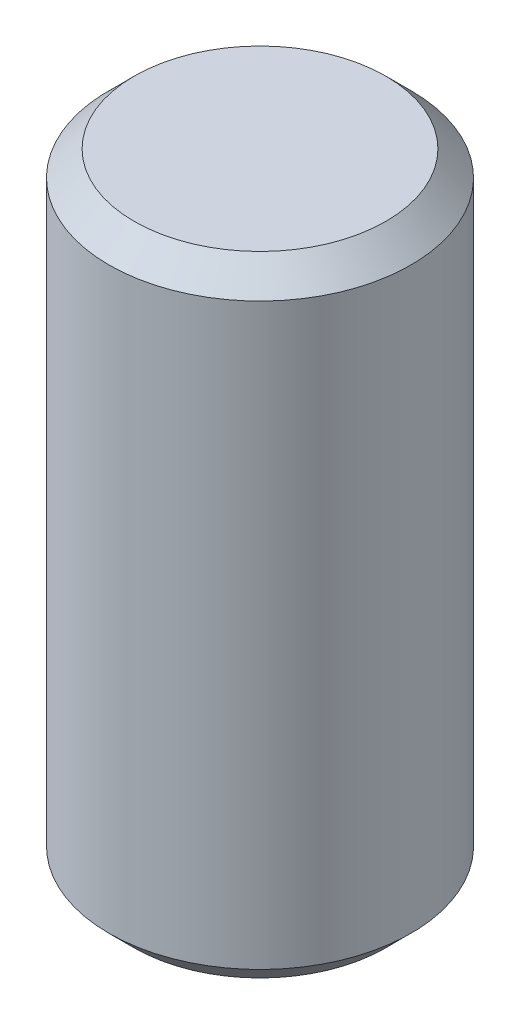
ISO-10303-21;
HEADER;
FILE_DESCRIPTION(('STEP AP214'),'2;1');
FILE_NAME('part.step','',(''),(''),'','','');
FILE_SCHEMA(('AUTOMOTIVE_DESIGN { 1 0 10303 214 1 1 1 1 }'));
ENDSEC;
DATA;
#1=APPLICATION_CONTEXT('core data for automotive mechanical design processes');
#2=APPLICATION_PROTOCOL_DEFINITION('international standard','automotive_design',2000,#1);
#3=PRODUCT_CONTEXT('',#1,'mechanical');
#4=PRODUCT('Part','Part','',(#3));
#5=PRODUCT_RELATED_PRODUCT_CATEGORY('part','',(#4));
#6=PRODUCT_DEFINITION_FORMATION('','',#4);
#7=PRODUCT_DEFINITION_CONTEXT('part definition',#1,'design');
#8=PRODUCT_DEFINITION('design','',#6,#7);
#9=PRODUCT_DEFINITION_SHAPE('','',#8);
#10=(LENGTH_UNIT() NAMED_UNIT(*) SI_UNIT(.MILLI.,.METRE.));
#11=(NAMED_UNIT(*) PLANE_ANGLE_UNIT() SI_UNIT($,.RADIAN.));
#12=(NAMED_UNIT(*) SI_UNIT($,.STERADIAN.) SOLID_ANGLE_UNIT());
#13=UNCERTAINTY_MEASURE_WITH_UNIT(LENGTH_MEASURE(1.E-05),#10,'distance_accuracy_value','');
#14=(GEOMETRIC_REPRESENTATION_CONTEXT(3) GLOBAL_UNCERTAINTY_ASSIGNED_CONTEXT((#13)) GLOBAL_UNIT_ASSIGNED_CONTEXT((#10,
#11,#12)) REPRESENTATION_CONTEXT('',''));
#15=CARTESIAN_POINT('',(0.,0.,0.));
#16=DIRECTION('',(0.,0.,1.));
#17=DIRECTION('',(1.,0.,0.));
#18=AXIS2_PLACEMENT_3D('',#15,#16,#17);
#19=CARTESIAN_POINT('',(0.,-6.35,0.));
#20=DIRECTION('',(0.,1.,0.));
#21=DIRECTION('',(0.,0.,1.));
#22=AXIS2_PLACEMENT_3D('',#19,#20,#21);
#23=PLANE('',#22);
#24=CARTESIAN_POINT('',(0.,-6.35,0.));
#25=DIRECTION('',(0.,1.,0.));
#26=DIRECTION('',(0.,0.,1.));
#27=AXIS2_PLACEMENT_3D('',#24,#25,#26);
#28=CIRCLE('',#27,2.54);
#29=CARTESIAN_POINT('',(0.,-6.35,2.54));
#30=VERTEX_POINT('',#29);
#31=EDGE_CURVE('E38',#30,#30,#28,.F.);
#32=ORIENTED_EDGE('',*,*,#31,.T.);
#33=EDGE_LOOP('',(#32));
#34=FACE_BOUND('',#33,.T.);
#35=ADVANCED_FACE('F31',(#34),#23,.F.);
#36=CARTESIAN_POINT('',(0.,6.08020788678209,0.));
#37=DIRECTION('',(0.,1.,0.));
#38=DIRECTION('',(0.,0.,1.));
#39=AXIS2_PLACEMENT_3D('',#36,#37,#38);
#40=CYLINDRICAL_SURFACE('',#39,3.048);
#41=CARTESIAN_POINT('',(0.,-5.84200000000001,0.));
#42=DIRECTION('',(0.,1.,0.));
#43=DIRECTION('',(0.,0.,1.));
#44=AXIS2_PLACEMENT_3D('',#41,#42,#43);
#45=CIRCLE('',#44,3.048);
#46=CARTESIAN_POINT('',(0.,-5.84200000000001,3.048));
#47=VERTEX_POINT('',#46);
#48=EDGE_CURVE('E42',#47,#47,#45,.T.);
#49=ORIENTED_EDGE('',*,*,#48,.T.);
#50=EDGE_LOOP('',(#49));
#51=FACE_BOUND('',#50,.T.);
#52=CARTESIAN_POINT('',(0.,5.842,0.));
#53=DIRECTION('',(0.,-1.,0.));
#54=DIRECTION('',(0.,0.,-1.));
#55=AXIS2_PLACEMENT_3D('',#52,#53,#54);
#56=CIRCLE('',#55,3.048);
#57=CARTESIAN_POINT('',(0.,5.842,-3.048));
#58=VERTEX_POINT('',#57);
#59=EDGE_CURVE('E46',#58,#58,#56,.T.);
#60=ORIENTED_EDGE('',*,*,#59,.T.);
#61=EDGE_LOOP('',(#60));
#62=FACE_BOUND('',#61,.T.);
#63=ADVANCED_FACE('F52',(#51,#62),#40,.T.);
#64=CARTESIAN_POINT('',(3.048,6.35,0.));
#65=DIRECTION('',(0.,-1.,0.));
#66=DIRECTION('',(0.,0.,-1.));
#67=AXIS2_PLACEMENT_3D('',#64,#65,#66);
#68=PLANE('',#67);
#69=CARTESIAN_POINT('',(0.,6.35,0.));
#70=DIRECTION('',(0.,-1.,0.));
#71=DIRECTION('',(0.,0.,-1.));
#72=AXIS2_PLACEMENT_3D('',#69,#70,#71);
#73=CIRCLE('',#72,2.54);
#74=CARTESIAN_POINT('',(0.,6.35,-2.54));
#75=VERTEX_POINT('',#74);
#76=EDGE_CURVE('E10',#75,#75,#73,.F.);
#77=ORIENTED_EDGE('',*,*,#76,.T.);
#78=EDGE_LOOP('',(#77));
#79=FACE_BOUND('',#78,.T.);
#80=ADVANCED_FACE('F60',(#79),#68,.F.);
#81=CARTESIAN_POINT('',(0.,-5.84200000000001,0.));
#82=DIRECTION('',(0.,1.,0.));
#83=DIRECTION('',(0.,0.,1.));
#84=AXIS2_PLACEMENT_3D('',#81,#82,#83);
#85=CONICAL_SURFACE('',#84,3.048,0.785398163397452);
#86=ORIENTED_EDGE('',*,*,#31,.F.);
#87=EDGE_LOOP('',(#86));
#88=FACE_BOUND('',#87,.T.);
#89=ORIENTED_EDGE('',*,*,#48,.F.);
#90=EDGE_LOOP('',(#89));
#91=FACE_BOUND('',#90,.T.);
#92=ADVANCED_FACE('F56',(#88,#91),#85,.T.);
#93=CARTESIAN_POINT('',(0.,6.35,0.));
#94=DIRECTION('',(0.,-1.,0.));
#95=DIRECTION('',(0.,0.,-1.));
#96=AXIS2_PLACEMENT_3D('',#93,#94,#95);
#97=CONICAL_SURFACE('',#96,2.54,0.785398163397447);
#98=ORIENTED_EDGE('',*,*,#59,.F.);
#99=EDGE_LOOP('',(#98));
#100=FACE_BOUND('',#99,.T.);
#101=ORIENTED_EDGE('',*,*,#76,.F.);
#102=EDGE_LOOP('',(#101));
#103=FACE_BOUND('',#102,.T.);
#104=ADVANCED_FACE('F33',(#100,#103),#97,.T.);
#105=CLOSED_SHELL('',(#35,#63,#80,#92,#104));
#106=MANIFOLD_SOLID_BREP('B2',#105);
#107=ADVANCED_BREP_SHAPE_REPRESENTATION('',(#18,#106),#14);
#108=SHAPE_DEFINITION_REPRESENTATION(#9,#107);
ENDSEC;
END-ISO-10303-21;
